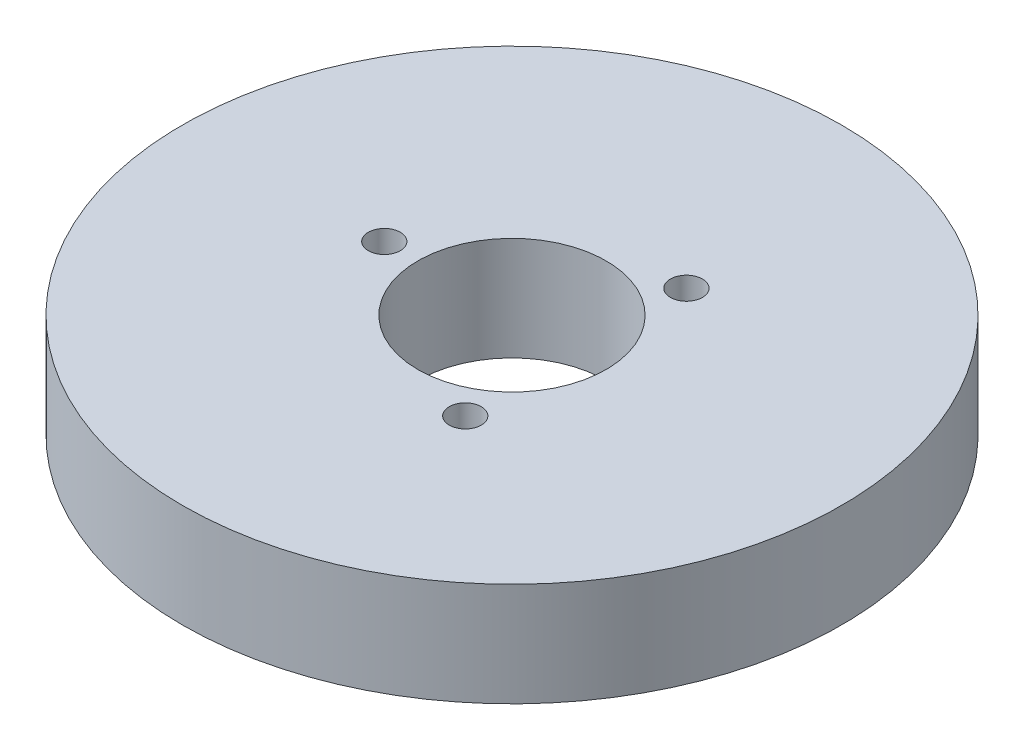
ISO-10303-21;
HEADER;
FILE_DESCRIPTION(('STEP AP214'),'2;1');
FILE_NAME('part.step','',(''),(''),'','','');
FILE_SCHEMA(('AUTOMOTIVE_DESIGN { 1 0 10303 214 1 1 1 1 }'));
ENDSEC;
DATA;
#1=APPLICATION_CONTEXT('core data for automotive mechanical design processes');
#2=APPLICATION_PROTOCOL_DEFINITION('international standard','automotive_design',2000,#1);
#3=PRODUCT_CONTEXT('',#1,'mechanical');
#4=PRODUCT('Part','Part','',(#3));
#5=PRODUCT_RELATED_PRODUCT_CATEGORY('part','',(#4));
#6=PRODUCT_DEFINITION_FORMATION('','',#4);
#7=PRODUCT_DEFINITION_CONTEXT('part definition',#1,'design');
#8=PRODUCT_DEFINITION('design','',#6,#7);
#9=PRODUCT_DEFINITION_SHAPE('','',#8);
#10=(LENGTH_UNIT() NAMED_UNIT(*) SI_UNIT(.MILLI.,.METRE.));
#11=(NAMED_UNIT(*) PLANE_ANGLE_UNIT() SI_UNIT($,.RADIAN.));
#12=(NAMED_UNIT(*) SI_UNIT($,.STERADIAN.) SOLID_ANGLE_UNIT());
#13=UNCERTAINTY_MEASURE_WITH_UNIT(LENGTH_MEASURE(1.E-05),#10,'distance_accuracy_value','');
#14=(GEOMETRIC_REPRESENTATION_CONTEXT(3) GLOBAL_UNCERTAINTY_ASSIGNED_CONTEXT((#13)) GLOBAL_UNIT_ASSIGNED_CONTEXT((#10,
#11,#12)) REPRESENTATION_CONTEXT('',''));
#15=CARTESIAN_POINT('',(0.,0.,0.));
#16=DIRECTION('',(0.,0.,1.));
#17=DIRECTION('',(1.,0.,0.));
#18=AXIS2_PLACEMENT_3D('',#15,#16,#17);
#19=CARTESIAN_POINT('',(0.,22.,0.));
#20=DIRECTION('',(0.,-1.,0.));
#21=DIRECTION('',(0.,0.,-1.));
#22=AXIS2_PLACEMENT_3D('',#19,#20,#21);
#23=CYLINDRICAL_SURFACE('',#22,70.);
#24=CARTESIAN_POINT('',(0.,22.,0.));
#25=DIRECTION('',(0.,1.,0.));
#26=DIRECTION('',(0.,0.,1.));
#27=AXIS2_PLACEMENT_3D('',#24,#25,#26);
#28=CIRCLE('',#27,70.);
#29=CARTESIAN_POINT('',(0.,22.,70.));
#30=VERTEX_POINT('',#29);
#31=EDGE_CURVE('E10',#30,#30,#28,.T.);
#32=ORIENTED_EDGE('',*,*,#31,.F.);
#33=EDGE_LOOP('',(#32));
#34=FACE_BOUND('',#33,.T.);
#35=CARTESIAN_POINT('',(0.,0.,0.));
#36=DIRECTION('',(0.,1.,0.));
#37=DIRECTION('',(0.,0.,1.));
#38=AXIS2_PLACEMENT_3D('',#35,#36,#37);
#39=CIRCLE('',#38,70.);
#40=CARTESIAN_POINT('',(0.,0.,70.));
#41=VERTEX_POINT('',#40);
#42=EDGE_CURVE('E37',#41,#41,#39,.T.);
#43=ORIENTED_EDGE('',*,*,#42,.T.);
#44=EDGE_LOOP('',(#43));
#45=FACE_BOUND('',#44,.T.);
#46=ADVANCED_FACE('F40',(#34,#45),#23,.T.);
#47=CARTESIAN_POINT('',(0.,22.,0.));
#48=DIRECTION('',(0.,1.,0.));
#49=DIRECTION('',(0.,0.,1.));
#50=AXIS2_PLACEMENT_3D('',#47,#48,#49);
#51=PLANE('',#50);
#52=CARTESIAN_POINT('',(13.5606415854056,22.,23.4877202091537));
#53=DIRECTION('',(0.,1.,0.));
#54=DIRECTION('',(0.866025403784436,0.,-0.500000000000004));
#55=AXIS2_PLACEMENT_3D('',#52,#53,#54);
#56=CIRCLE('',#55,3.3999783203257);
#57=CARTESIAN_POINT('',(16.505109183124,22.,21.7877310489908));
#58=VERTEX_POINT('',#57);
#59=EDGE_CURVE('E70',#58,#58,#56,.T.);
#60=ORIENTED_EDGE('',*,*,#59,.F.);
#61=EDGE_LOOP('',(#60));
#62=FACE_BOUND('',#61,.T.);
#63=CARTESIAN_POINT('',(13.5606415854053,22.,-23.4877202091539));
#64=DIRECTION('',(0.,1.,0.));
#65=DIRECTION('',(-0.866025403784443,0.,-0.499999999999992));
#66=AXIS2_PLACEMENT_3D('',#63,#64,#65);
#67=CIRCLE('',#66,3.3999783203257);
#68=CARTESIAN_POINT('',(10.6161739876869,22.,-25.1877093693167));
#69=VERTEX_POINT('',#68);
#70=EDGE_CURVE('E61',#69,#69,#67,.T.);
#71=ORIENTED_EDGE('',*,*,#70,.F.);
#72=EDGE_LOOP('',(#71));
#73=FACE_BOUND('',#72,.T.);
#74=CARTESIAN_POINT('',(-27.121283170811,22.,0.));
#75=DIRECTION('',(0.,1.,0.));
#76=DIRECTION('',(0.,0.,1.));
#77=AXIS2_PLACEMENT_3D('',#74,#75,#76);
#78=CIRCLE('',#77,3.3999783203257);
#79=CARTESIAN_POINT('',(-27.121283170811,22.,3.3999783203257));
#80=VERTEX_POINT('',#79);
#81=EDGE_CURVE('E54',#80,#80,#78,.T.);
#82=ORIENTED_EDGE('',*,*,#81,.F.);
#83=EDGE_LOOP('',(#82));
#84=FACE_BOUND('',#83,.T.);
#85=CARTESIAN_POINT('',(0.,22.,0.));
#86=DIRECTION('',(0.,1.,0.));
#87=DIRECTION('',(0.,0.,1.));
#88=AXIS2_PLACEMENT_3D('',#85,#86,#87);
#89=CIRCLE('',#88,20.);
#90=CARTESIAN_POINT('',(0.,22.,20.));
#91=VERTEX_POINT('',#90);
#92=EDGE_CURVE('E50',#91,#91,#89,.T.);
#93=ORIENTED_EDGE('',*,*,#92,.F.);
#94=EDGE_LOOP('',(#93));
#95=FACE_BOUND('',#94,.T.);
#96=ORIENTED_EDGE('',*,*,#31,.T.);
#97=EDGE_LOOP('',(#96));
#98=FACE_BOUND('',#97,.T.);
#99=ADVANCED_FACE('F85',(#62,#73,#84,#95,#98),#51,.T.);
#100=CARTESIAN_POINT('',(0.,0.,0.));
#101=DIRECTION('',(0.,1.,0.));
#102=DIRECTION('',(0.,0.,1.));
#103=AXIS2_PLACEMENT_3D('',#100,#101,#102);
#104=PLANE('',#103);
#105=CARTESIAN_POINT('',(0.,0.,0.));
#106=DIRECTION('',(0.,1.,0.));
#107=DIRECTION('',(0.,0.,1.));
#108=AXIS2_PLACEMENT_3D('',#105,#106,#107);
#109=CIRCLE('',#108,20.);
#110=CARTESIAN_POINT('',(0.,0.,20.));
#111=VERTEX_POINT('',#110);
#112=EDGE_CURVE('E47',#111,#111,#109,.T.);
#113=ORIENTED_EDGE('',*,*,#112,.T.);
#114=EDGE_LOOP('',(#113));
#115=FACE_BOUND('',#114,.T.);
#116=ORIENTED_EDGE('',*,*,#42,.F.);
#117=EDGE_LOOP('',(#116));
#118=FACE_BOUND('',#117,.T.);
#119=ADVANCED_FACE('F84',(#115,#118),#104,.F.);
#120=CARTESIAN_POINT('',(0.,22.,0.));
#121=DIRECTION('',(0.,-1.,0.));
#122=DIRECTION('',(0.,0.,-1.));
#123=AXIS2_PLACEMENT_3D('',#120,#121,#122);
#124=CYLINDRICAL_SURFACE('',#123,20.);
#125=ORIENTED_EDGE('',*,*,#92,.T.);
#126=EDGE_LOOP('',(#125));
#127=FACE_BOUND('',#126,.T.);
#128=ORIENTED_EDGE('',*,*,#112,.F.);
#129=EDGE_LOOP('',(#128));
#130=FACE_BOUND('',#129,.T.);
#131=ADVANCED_FACE('F91',(#127,#130),#124,.F.);
#132=CARTESIAN_POINT('',(-27.121283170811,4.3969840482746,0.));
#133=DIRECTION('',(0.,1.,0.));
#134=DIRECTION('',(0.,0.,1.));
#135=AXIS2_PLACEMENT_3D('',#132,#133,#134);
#136=CYLINDRICAL_SURFACE('',#135,3.3999783203257);
#137=CARTESIAN_POINT('',(-27.121283170811,4.3969840482746,0.));
#138=DIRECTION('',(0.,1.,0.));
#139=DIRECTION('',(0.,0.,1.));
#140=AXIS2_PLACEMENT_3D('',#137,#138,#139);
#141=CIRCLE('',#140,3.3999783203257);
#142=CARTESIAN_POINT('',(-27.121283170811,4.3969840482746,3.3999783203257));
#143=VERTEX_POINT('',#142);
#144=EDGE_CURVE('E55',#143,#143,#141,.T.);
#145=ORIENTED_EDGE('',*,*,#144,.F.);
#146=EDGE_LOOP('',(#145));
#147=FACE_BOUND('',#146,.T.);
#148=ORIENTED_EDGE('',*,*,#81,.T.);
#149=EDGE_LOOP('',(#148));
#150=FACE_BOUND('',#149,.T.);
#151=ADVANCED_FACE('F96',(#147,#150),#136,.F.);
#152=CARTESIAN_POINT('',(-27.121283170811,4.3969840482746,0.));
#153=DIRECTION('',(0.,1.,0.));
#154=DIRECTION('',(0.,0.,1.));
#155=AXIS2_PLACEMENT_3D('',#152,#153,#154);
#156=PLANE('',#155);
#157=ORIENTED_EDGE('',*,*,#144,.T.);
#158=EDGE_LOOP('',(#157));
#159=FACE_BOUND('',#158,.T.);
#160=ADVANCED_FACE('F127',(#159),#156,.T.);
#161=CARTESIAN_POINT('',(13.5606415854053,4.3969840482746,-23.4877202091539));
#162=DIRECTION('',(0.,1.,0.));
#163=DIRECTION('',(0.,0.,1.));
#164=AXIS2_PLACEMENT_3D('',#161,#162,#163);
#165=CYLINDRICAL_SURFACE('',#164,3.3999783203257);
#166=CARTESIAN_POINT('',(13.5606415854053,4.3969840482746,-23.4877202091539));
#167=DIRECTION('',(0.,1.,0.));
#168=DIRECTION('',(-0.866025403784443,0.,-0.499999999999992));
#169=AXIS2_PLACEMENT_3D('',#166,#167,#168);
#170=CIRCLE('',#169,3.3999783203257);
#171=CARTESIAN_POINT('',(10.6161739876869,4.3969840482746,-25.1877093693167));
#172=VERTEX_POINT('',#171);
#173=EDGE_CURVE('E63',#172,#172,#170,.T.);
#174=ORIENTED_EDGE('',*,*,#173,.F.);
#175=EDGE_LOOP('',(#174));
#176=FACE_BOUND('',#175,.T.);
#177=ORIENTED_EDGE('',*,*,#70,.T.);
#178=EDGE_LOOP('',(#177));
#179=FACE_BOUND('',#178,.T.);
#180=ADVANCED_FACE('F133',(#176,#179),#165,.F.);
#181=CARTESIAN_POINT('',(13.5606415854053,4.3969840482746,-23.4877202091539));
#182=DIRECTION('',(0.,1.,0.));
#183=DIRECTION('',(-0.866025403784443,0.,-0.499999999999992));
#184=AXIS2_PLACEMENT_3D('',#181,#182,#183);
#185=PLANE('',#184);
#186=ORIENTED_EDGE('',*,*,#173,.T.);
#187=EDGE_LOOP('',(#186));
#188=FACE_BOUND('',#187,.T.);
#189=ADVANCED_FACE('F77',(#188),#185,.T.);
#190=CARTESIAN_POINT('',(13.5606415854056,4.3969840482746,23.4877202091537));
#191=DIRECTION('',(0.,1.,0.));
#192=DIRECTION('',(0.,0.,1.));
#193=AXIS2_PLACEMENT_3D('',#190,#191,#192);
#194=CYLINDRICAL_SURFACE('',#193,3.3999783203257);
#195=CARTESIAN_POINT('',(13.5606415854056,4.3969840482746,23.4877202091537));
#196=DIRECTION('',(0.,1.,0.));
#197=DIRECTION('',(0.866025403784436,0.,-0.500000000000004));
#198=AXIS2_PLACEMENT_3D('',#195,#196,#197);
#199=CIRCLE('',#198,3.3999783203257);
#200=CARTESIAN_POINT('',(16.505109183124,4.3969840482746,21.7877310489908));
#201=VERTEX_POINT('',#200);
#202=EDGE_CURVE('E59',#201,#201,#199,.T.);
#203=ORIENTED_EDGE('',*,*,#202,.F.);
#204=EDGE_LOOP('',(#203));
#205=FACE_BOUND('',#204,.T.);
#206=ORIENTED_EDGE('',*,*,#59,.T.);
#207=EDGE_LOOP('',(#206));
#208=FACE_BOUND('',#207,.T.);
#209=ADVANCED_FACE('F73',(#205,#208),#194,.F.);
#210=CARTESIAN_POINT('',(13.5606415854056,4.3969840482746,23.4877202091537));
#211=DIRECTION('',(0.,1.,0.));
#212=DIRECTION('',(0.866025403784436,0.,-0.500000000000004));
#213=AXIS2_PLACEMENT_3D('',#210,#211,#212);
#214=PLANE('',#213);
#215=ORIENTED_EDGE('',*,*,#202,.T.);
#216=EDGE_LOOP('',(#215));
#217=FACE_BOUND('',#216,.T.);
#218=ADVANCED_FACE('F71',(#217),#214,.T.);
#219=CLOSED_SHELL('',(#46,#99,#119,#131,#151,#160,#180,#189,#209,#218));
#220=MANIFOLD_SOLID_BREP('B2',#219);
#221=ADVANCED_BREP_SHAPE_REPRESENTATION('',(#18,#220),#14);
#222=SHAPE_DEFINITION_REPRESENTATION(#9,#221);
ENDSEC;
END-ISO-10303-21;
